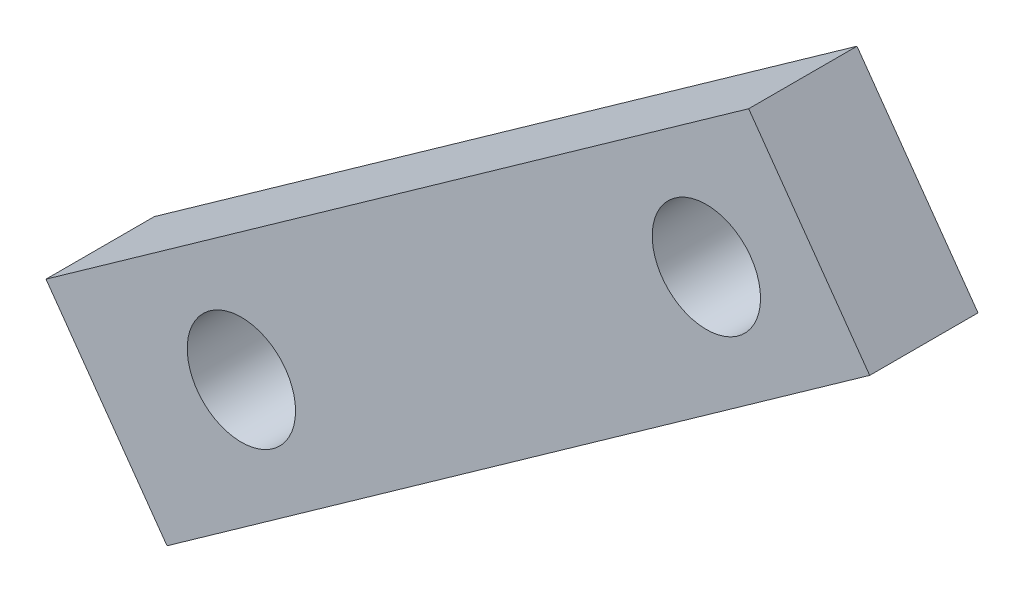
ISO-10303-21;
HEADER;
FILE_DESCRIPTION(('STEP AP214'),'2;1');
FILE_NAME('part.step','',(''),(''),'','','');
FILE_SCHEMA(('AUTOMOTIVE_DESIGN { 1 0 10303 214 1 1 1 1 }'));
ENDSEC;
DATA;
#1=APPLICATION_CONTEXT('core data for automotive mechanical design processes');
#2=APPLICATION_PROTOCOL_DEFINITION('international standard','automotive_design',2000,#1);
#3=PRODUCT_CONTEXT('',#1,'mechanical');
#4=PRODUCT('Part','Part','',(#3));
#5=PRODUCT_RELATED_PRODUCT_CATEGORY('part','',(#4));
#6=PRODUCT_DEFINITION_FORMATION('','',#4);
#7=PRODUCT_DEFINITION_CONTEXT('part definition',#1,'design');
#8=PRODUCT_DEFINITION('design','',#6,#7);
#9=PRODUCT_DEFINITION_SHAPE('','',#8);
#10=(LENGTH_UNIT() NAMED_UNIT(*) SI_UNIT(.MILLI.,.METRE.));
#11=(NAMED_UNIT(*) PLANE_ANGLE_UNIT() SI_UNIT($,.RADIAN.));
#12=(NAMED_UNIT(*) SI_UNIT($,.STERADIAN.) SOLID_ANGLE_UNIT());
#13=UNCERTAINTY_MEASURE_WITH_UNIT(LENGTH_MEASURE(1.E-05),#10,'distance_accuracy_value','');
#14=(GEOMETRIC_REPRESENTATION_CONTEXT(3) GLOBAL_UNCERTAINTY_ASSIGNED_CONTEXT((#13)) GLOBAL_UNIT_ASSIGNED_CONTEXT((#10,
#11,#12)) REPRESENTATION_CONTEXT('',''));
#15=CARTESIAN_POINT('',(0.,0.,0.));
#16=DIRECTION('',(0.,0.,1.));
#17=DIRECTION('',(1.,0.,0.));
#18=AXIS2_PLACEMENT_3D('',#15,#16,#17);
#19=CARTESIAN_POINT('',(-27.2248295079152,-19.3296289506199,2.54));
#20=DIRECTION('',(0.815382984620275,0.578921919080399,0.));
#21=DIRECTION('',(-0.578921919080399,0.815382984620275,0.));
#22=AXIS2_PLACEMENT_3D('',#19,#20,#21);
#23=PLANE('',#22);
#24=DIRECTION('',(0.578921919080399,-0.815382984620275,0.));
#25=VECTOR('',#24,1.);
#26=CARTESIAN_POINT('',(-27.2248295079152,-19.3296289506199,0.));
#27=LINE('',#26,#25);
#28=CARTESIAN_POINT('',(-36.3747837493232,-6.44236945567908,0.));
#29=VERTEX_POINT('',#28);
#30=CARTESIAN_POINT('',(-33.5368324181958,-10.4394840065628,0.));
#31=VERTEX_POINT('',#30);
#32=EDGE_CURVE('E106',#29,#31,#27,.T.);
#33=ORIENTED_EDGE('',*,*,#32,.T.);
#34=DIRECTION('',(0.,0.,-1.));
#35=VECTOR('',#34,1.);
#36=CARTESIAN_POINT('',(-33.5368324181958,-10.4394840065628,2.54));
#37=LINE('',#36,#35);
#38=CARTESIAN_POINT('',(-33.5368324181958,-10.4394840065628,2.54));
#39=VERTEX_POINT('',#38);
#40=EDGE_CURVE('E11',#39,#31,#37,.T.);
#41=ORIENTED_EDGE('',*,*,#40,.F.);
#42=DIRECTION('',(0.578921919080399,-0.815382984620275,0.));
#43=VECTOR('',#42,1.);
#44=CARTESIAN_POINT('',(-27.2248295079152,-19.3296289506199,2.54));
#45=LINE('',#44,#43);
#46=CARTESIAN_POINT('',(-36.3747837493232,-6.44236945567908,2.54));
#47=VERTEX_POINT('',#46);
#48=EDGE_CURVE('E86',#47,#39,#45,.T.);
#49=ORIENTED_EDGE('',*,*,#48,.F.);
#50=DIRECTION('',(0.,0.,-1.));
#51=VECTOR('',#50,1.);
#52=CARTESIAN_POINT('',(-36.3747837493232,-6.44236945567908,2.54));
#53=LINE('',#52,#51);
#54=EDGE_CURVE('E52',#47,#29,#53,.T.);
#55=ORIENTED_EDGE('',*,*,#54,.T.);
#56=EDGE_LOOP('',(#33,#41,#49,#55));
#57=FACE_BOUND('',#56,.T.);
#58=ADVANCED_FACE('F35',(#57),#23,.F.);
#59=CARTESIAN_POINT('',(-6.31200291028061,8.89014494405712,2.54));
#60=DIRECTION('',(-0.5789219190804,0.815382984620275,0.));
#61=DIRECTION('',(-0.815382984620275,-0.5789219190804,0.));
#62=AXIS2_PLACEMENT_3D('',#59,#60,#61);
#63=PLANE('',#62);
#64=DIRECTION('',(0.815382984620275,0.5789219190804,0.));
#65=VECTOR('',#64,1.);
#66=CARTESIAN_POINT('',(-6.31200291028061,8.89014494405712,0.));
#67=LINE('',#66,#65);
#68=CARTESIAN_POINT('',(-17.057944121058,1.26052668440513,0.));
#69=VERTEX_POINT('',#68);
#70=EDGE_CURVE('E91',#31,#69,#67,.T.);
#71=ORIENTED_EDGE('',*,*,#70,.T.);
#72=DIRECTION('',(0.,0.,-1.));
#73=VECTOR('',#72,1.);
#74=CARTESIAN_POINT('',(-17.057944121058,1.26052668440513,2.54));
#75=LINE('',#74,#73);
#76=CARTESIAN_POINT('',(-17.057944121058,1.26052668440513,2.54));
#77=VERTEX_POINT('',#76);
#78=EDGE_CURVE('E44',#77,#69,#75,.T.);
#79=ORIENTED_EDGE('',*,*,#78,.F.);
#80=DIRECTION('',(0.815382984620275,0.5789219190804,0.));
#81=VECTOR('',#80,1.);
#82=CARTESIAN_POINT('',(-6.31200291028061,8.89014494405712,2.54));
#83=LINE('',#82,#81);
#84=EDGE_CURVE('E78',#39,#77,#83,.T.);
#85=ORIENTED_EDGE('',*,*,#84,.F.);
#86=ORIENTED_EDGE('',*,*,#40,.T.);
#87=EDGE_LOOP('',(#71,#79,#85,#86));
#88=FACE_BOUND('',#87,.T.);
#89=ADVANCED_FACE('F90',(#88),#63,.F.);
#90=CARTESIAN_POINT('',(-10.7459412107774,-7.62961825965199,2.54));
#91=DIRECTION('',(-0.815382984620275,-0.578921919080399,0.));
#92=DIRECTION('',(0.578921919080399,-0.815382984620275,0.));
#93=AXIS2_PLACEMENT_3D('',#90,#91,#92);
#94=PLANE('',#93);
#95=DIRECTION('',(-0.578921919080399,0.815382984620275,0.));
#96=VECTOR('',#95,1.);
#97=CARTESIAN_POINT('',(-10.7459412107774,-7.62961825965199,0.));
#98=LINE('',#97,#96);
#99=CARTESIAN_POINT('',(-19.8958954521854,5.25764123528883,0.));
#100=VERTEX_POINT('',#99);
#101=EDGE_CURVE('E109',#69,#100,#98,.T.);
#102=ORIENTED_EDGE('',*,*,#101,.T.);
#103=DIRECTION('',(0.,0.,-1.));
#104=VECTOR('',#103,1.);
#105=CARTESIAN_POINT('',(-19.8958954521854,5.25764123528883,2.54));
#106=LINE('',#105,#104);
#107=CARTESIAN_POINT('',(-19.8958954521854,5.25764123528883,2.54));
#108=VERTEX_POINT('',#107);
#109=EDGE_CURVE('E67',#108,#100,#106,.T.);
#110=ORIENTED_EDGE('',*,*,#109,.F.);
#111=DIRECTION('',(-0.578921919080399,0.815382984620275,0.));
#112=VECTOR('',#111,1.);
#113=CARTESIAN_POINT('',(-10.7459412107774,-7.62961825965199,2.54));
#114=LINE('',#113,#112);
#115=EDGE_CURVE('E85',#77,#108,#114,.T.);
#116=ORIENTED_EDGE('',*,*,#115,.F.);
#117=ORIENTED_EDGE('',*,*,#78,.T.);
#118=EDGE_LOOP('',(#102,#110,#116,#117));
#119=FACE_BOUND('',#118,.T.);
#120=ADVANCED_FACE('F94',(#119),#94,.F.);
#121=CARTESIAN_POINT('',(-9.14995424140803,12.8872594949408,2.54));
#122=DIRECTION('',(-0.578921919080399,0.815382984620275,0.));
#123=DIRECTION('',(-0.815382984620275,-0.578921919080399,0.));
#124=AXIS2_PLACEMENT_3D('',#121,#122,#123);
#125=PLANE('',#124);
#126=DIRECTION('',(0.815382984620275,0.578921919080399,0.));
#127=VECTOR('',#126,1.);
#128=CARTESIAN_POINT('',(-9.14995424140803,12.8872594949408,0.));
#129=LINE('',#128,#127);
#130=EDGE_CURVE('E111',#29,#100,#129,.T.);
#131=ORIENTED_EDGE('',*,*,#130,.F.);
#132=ORIENTED_EDGE('',*,*,#54,.F.);
#133=DIRECTION('',(0.815382984620275,0.578921919080399,0.));
#134=VECTOR('',#133,1.);
#135=CARTESIAN_POINT('',(-9.14995424140803,12.8872594949408,2.54));
#136=LINE('',#135,#134);
#137=EDGE_CURVE('E95',#47,#108,#136,.T.);
#138=ORIENTED_EDGE('',*,*,#137,.T.);
#139=ORIENTED_EDGE('',*,*,#109,.T.);
#140=EDGE_LOOP('',(#131,#132,#138,#139));
#141=FACE_BOUND('',#140,.T.);
#142=ADVANCED_FACE('F147',(#141),#125,.T.);
#143=CARTESIAN_POINT('',(-31.792264865773,-6.1948110463505,2.54));
#144=DIRECTION('',(0.,0.,-1.));
#145=DIRECTION('',(-1.,0.,0.));
#146=AXIS2_PLACEMENT_3D('',#143,#144,#145);
#147=CYLINDRICAL_SURFACE('',#146,1.27);
#148=CARTESIAN_POINT('',(-31.792264865773,-6.1948110463505,2.54));
#149=DIRECTION('',(0.,0.,1.));
#150=DIRECTION('',(1.,0.,0.));
#151=AXIS2_PLACEMENT_3D('',#148,#149,#150);
#152=CIRCLE('',#151,1.27);
#153=CARTESIAN_POINT('',(-30.522264865773,-6.1948110463505,2.54));
#154=VERTEX_POINT('',#153);
#155=EDGE_CURVE('E117',#154,#154,#152,.T.);
#156=ORIENTED_EDGE('',*,*,#155,.T.);
#157=EDGE_LOOP('',(#156));
#158=FACE_BOUND('',#157,.T.);
#159=CARTESIAN_POINT('',(-31.792264865773,-6.1948110463505,0.));
#160=DIRECTION('',(0.,0.,1.));
#161=DIRECTION('',(1.,0.,0.));
#162=AXIS2_PLACEMENT_3D('',#159,#160,#161);
#163=CIRCLE('',#162,1.27);
#164=CARTESIAN_POINT('',(-30.522264865773,-6.1948110463505,0.));
#165=VERTEX_POINT('',#164);
#166=EDGE_CURVE('E103',#165,#165,#163,.T.);
#167=ORIENTED_EDGE('',*,*,#166,.F.);
#168=EDGE_LOOP('',(#167));
#169=FACE_BOUND('',#168,.T.);
#170=ADVANCED_FACE('F37',(#158,#169),#147,.F.);
#171=CARTESIAN_POINT('',(-20.8880267094532,1.54719804463662,2.54));
#172=DIRECTION('',(0.,0.,-1.));
#173=DIRECTION('',(-1.,0.,0.));
#174=AXIS2_PLACEMENT_3D('',#171,#172,#173);
#175=CYLINDRICAL_SURFACE('',#174,1.27);
#176=CARTESIAN_POINT('',(-20.8880267094532,1.54719804463662,2.54));
#177=DIRECTION('',(0.,0.,1.));
#178=DIRECTION('',(1.,0.,0.));
#179=AXIS2_PLACEMENT_3D('',#176,#177,#178);
#180=CIRCLE('',#179,1.27);
#181=CARTESIAN_POINT('',(-19.6180267094532,1.54719804463662,2.54));
#182=VERTEX_POINT('',#181);
#183=EDGE_CURVE('E97',#182,#182,#180,.T.);
#184=ORIENTED_EDGE('',*,*,#183,.T.);
#185=EDGE_LOOP('',(#184));
#186=FACE_BOUND('',#185,.T.);
#187=CARTESIAN_POINT('',(-20.8880267094532,1.54719804463662,0.));
#188=DIRECTION('',(0.,0.,1.));
#189=DIRECTION('',(1.,0.,0.));
#190=AXIS2_PLACEMENT_3D('',#187,#188,#189);
#191=CIRCLE('',#190,1.27);
#192=CARTESIAN_POINT('',(-19.6180267094532,1.54719804463662,0.));
#193=VERTEX_POINT('',#192);
#194=EDGE_CURVE('E114',#193,#193,#191,.T.);
#195=ORIENTED_EDGE('',*,*,#194,.F.);
#196=EDGE_LOOP('',(#195));
#197=FACE_BOUND('',#196,.T.);
#198=ADVANCED_FACE('F129',(#186,#197),#175,.F.);
#199=CARTESIAN_POINT('',(0.,0.,2.54));
#200=DIRECTION('',(0.,0.,1.));
#201=DIRECTION('',(1.,0.,0.));
#202=AXIS2_PLACEMENT_3D('',#199,#200,#201);
#203=PLANE('',#202);
#204=ORIENTED_EDGE('',*,*,#155,.F.);
#205=EDGE_LOOP('',(#204));
#206=FACE_BOUND('',#205,.T.);
#207=ORIENTED_EDGE('',*,*,#48,.T.);
#208=ORIENTED_EDGE('',*,*,#84,.T.);
#209=ORIENTED_EDGE('',*,*,#115,.T.);
#210=ORIENTED_EDGE('',*,*,#137,.F.);
#211=EDGE_LOOP('',(#207,#208,#209,#210));
#212=FACE_BOUND('',#211,.T.);
#213=ORIENTED_EDGE('',*,*,#183,.F.);
#214=EDGE_LOOP('',(#213));
#215=FACE_BOUND('',#214,.T.);
#216=ADVANCED_FACE('F81',(#206,#212,#215),#203,.T.);
#217=CARTESIAN_POINT('',(0.,0.,0.));
#218=DIRECTION('',(0.,0.,1.));
#219=DIRECTION('',(1.,0.,0.));
#220=AXIS2_PLACEMENT_3D('',#217,#218,#219);
#221=PLANE('',#220);
#222=ORIENTED_EDGE('',*,*,#166,.T.);
#223=EDGE_LOOP('',(#222));
#224=FACE_BOUND('',#223,.T.);
#225=ORIENTED_EDGE('',*,*,#32,.F.);
#226=ORIENTED_EDGE('',*,*,#130,.T.);
#227=ORIENTED_EDGE('',*,*,#101,.F.);
#228=ORIENTED_EDGE('',*,*,#70,.F.);
#229=EDGE_LOOP('',(#225,#226,#227,#228));
#230=FACE_BOUND('',#229,.T.);
#231=ORIENTED_EDGE('',*,*,#194,.T.);
#232=EDGE_LOOP('',(#231));
#233=FACE_BOUND('',#232,.T.);
#234=ADVANCED_FACE('F128',(#224,#230,#233),#221,.F.);
#235=CLOSED_SHELL('',(#58,#89,#120,#142,#170,#198,#216,#234));
#236=MANIFOLD_SOLID_BREP('B2',#235);
#237=ADVANCED_BREP_SHAPE_REPRESENTATION('',(#18,#236),#14);
#238=SHAPE_DEFINITION_REPRESENTATION(#9,#237);
ENDSEC;
END-ISO-10303-21;
